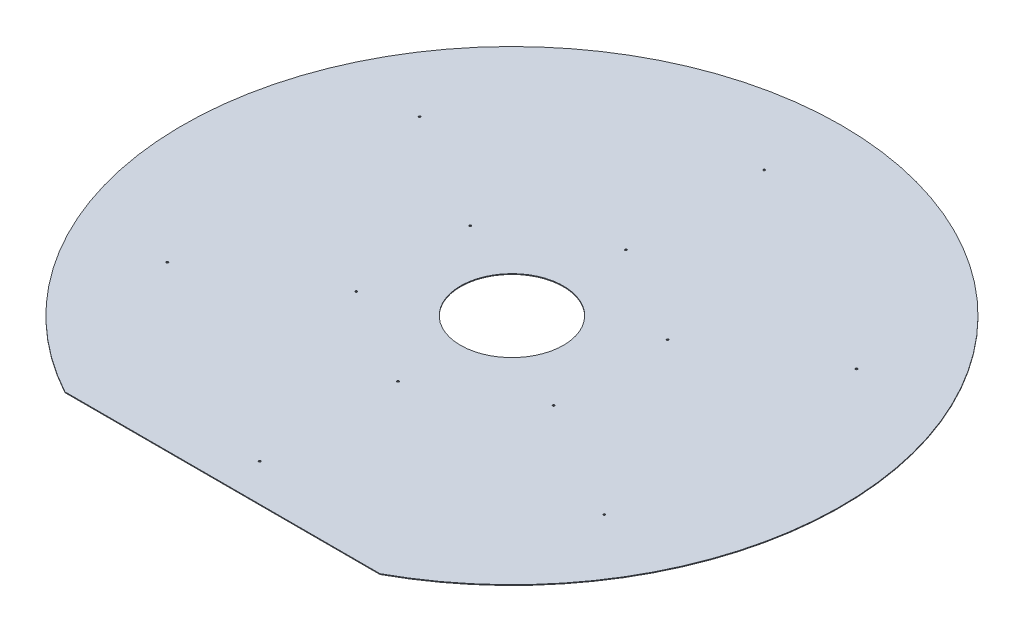
ISO-10303-21;
HEADER;
FILE_DESCRIPTION(('STEP AP214'),'2;1');
FILE_NAME('part.step','',(''),(''),'','','');
FILE_SCHEMA(('AUTOMOTIVE_DESIGN { 1 0 10303 214 1 1 1 1 }'));
ENDSEC;
DATA;
#1=APPLICATION_CONTEXT('core data for automotive mechanical design processes');
#2=APPLICATION_PROTOCOL_DEFINITION('international standard','automotive_design',2000,#1);
#3=PRODUCT_CONTEXT('',#1,'mechanical');
#4=PRODUCT('Part','Part','',(#3));
#5=PRODUCT_RELATED_PRODUCT_CATEGORY('part','',(#4));
#6=PRODUCT_DEFINITION_FORMATION('','',#4);
#7=PRODUCT_DEFINITION_CONTEXT('part definition',#1,'design');
#8=PRODUCT_DEFINITION('design','',#6,#7);
#9=PRODUCT_DEFINITION_SHAPE('','',#8);
#10=(LENGTH_UNIT() NAMED_UNIT(*) SI_UNIT(.MILLI.,.METRE.));
#11=(NAMED_UNIT(*) PLANE_ANGLE_UNIT() SI_UNIT($,.RADIAN.));
#12=(NAMED_UNIT(*) SI_UNIT($,.STERADIAN.) SOLID_ANGLE_UNIT());
#13=UNCERTAINTY_MEASURE_WITH_UNIT(LENGTH_MEASURE(1.E-05),#10,'distance_accuracy_value','');
#14=(GEOMETRIC_REPRESENTATION_CONTEXT(3) GLOBAL_UNCERTAINTY_ASSIGNED_CONTEXT((#13)) GLOBAL_UNIT_ASSIGNED_CONTEXT((#10,
#11,#12)) REPRESENTATION_CONTEXT('',''));
#15=CARTESIAN_POINT('',(0.,0.,0.));
#16=DIRECTION('',(0.,0.,1.));
#17=DIRECTION('',(1.,0.,0.));
#18=AXIS2_PLACEMENT_3D('',#15,#16,#17);
#19=CARTESIAN_POINT('',(0.,971.5,0.));
#20=DIRECTION('',(0.,1.,0.));
#21=DIRECTION('',(0.,0.,1.));
#22=AXIS2_PLACEMENT_3D('',#19,#20,#21);
#23=PLANE('',#22);
#24=CARTESIAN_POINT('',(0.,971.5,510.575));
#25=DIRECTION('',(0.,1.,0.));
#26=DIRECTION('',(0.,0.,1.));
#27=AXIS2_PLACEMENT_3D('',#24,#25,#26);
#28=CIRCLE('',#27,2.10000000000001);
#29=CARTESIAN_POINT('',(0.,971.5,512.675));
#30=VERTEX_POINT('',#29);
#31=EDGE_CURVE('E129',#30,#30,#28,.T.);
#32=ORIENTED_EDGE('',*,*,#31,.F.);
#33=EDGE_LOOP('',(#32));
#34=FACE_BOUND('',#33,.T.);
#35=CARTESIAN_POINT('',(199.683807477598,971.5,115.287499999998));
#36=DIRECTION('',(0.,1.,0.));
#37=DIRECTION('',(-0.866025403784443,0.,-0.499999999999992));
#38=AXIS2_PLACEMENT_3D('',#35,#36,#37);
#39=CIRCLE('',#38,2.1);
#40=CARTESIAN_POINT('',(197.865154129651,971.5,114.237499999998));
#41=VERTEX_POINT('',#40);
#42=EDGE_CURVE('E130',#41,#41,#39,.T.);
#43=ORIENTED_EDGE('',*,*,#42,.F.);
#44=EDGE_LOOP('',(#43));
#45=FACE_BOUND('',#44,.T.);
#46=CARTESIAN_POINT('',(442.170920537242,971.5,255.287499999996));
#47=DIRECTION('',(0.,1.,0.));
#48=DIRECTION('',(0.866025403784443,0.,0.499999999999992));
#49=AXIS2_PLACEMENT_3D('',#46,#47,#48);
#50=CIRCLE('',#49,2.10000000000001);
#51=CARTESIAN_POINT('',(443.989573885189,971.5,256.337499999996));
#52=VERTEX_POINT('',#51);
#53=EDGE_CURVE('E141',#52,#52,#50,.T.);
#54=ORIENTED_EDGE('',*,*,#53,.F.);
#55=EDGE_LOOP('',(#54));
#56=FACE_BOUND('',#55,.T.);
#57=CARTESIAN_POINT('',(199.683807477596,971.5,-115.287500000002));
#58=DIRECTION('',(0.,1.,0.));
#59=DIRECTION('',(-0.866025403784433,0.,0.50000000000001));
#60=AXIS2_PLACEMENT_3D('',#57,#58,#59);
#61=CIRCLE('',#60,2.1);
#62=CARTESIAN_POINT('',(197.865154129648,971.5,-114.237500000002));
#63=VERTEX_POINT('',#62);
#64=EDGE_CURVE('E142',#63,#63,#61,.T.);
#65=ORIENTED_EDGE('',*,*,#64,.F.);
#66=EDGE_LOOP('',(#65));
#67=FACE_BOUND('',#66,.T.);
#68=CARTESIAN_POINT('',(0.,971.5,230.575));
#69=DIRECTION('',(0.,1.,0.));
#70=DIRECTION('',(0.,0.,-1.));
#71=AXIS2_PLACEMENT_3D('',#68,#69,#70);
#72=CIRCLE('',#71,2.1);
#73=CARTESIAN_POINT('',(0.,971.5,228.475));
#74=VERTEX_POINT('',#73);
#75=EDGE_CURVE('E106',#74,#74,#72,.T.);
#76=ORIENTED_EDGE('',*,*,#75,.F.);
#77=EDGE_LOOP('',(#76));
#78=FACE_BOUND('',#77,.T.);
#79=CARTESIAN_POINT('',(-442.170920537239,971.5,255.287500000002));
#80=DIRECTION('',(0.,1.,0.));
#81=DIRECTION('',(-0.866025403784436,0.,0.500000000000004));
#82=AXIS2_PLACEMENT_3D('',#79,#80,#81);
#83=CIRCLE('',#82,2.10000000000001);
#84=CARTESIAN_POINT('',(-443.989573885186,971.5,256.337500000002));
#85=VERTEX_POINT('',#84);
#86=EDGE_CURVE('E105',#85,#85,#83,.T.);
#87=ORIENTED_EDGE('',*,*,#86,.F.);
#88=EDGE_LOOP('',(#87));
#89=FACE_BOUND('',#88,.T.);
#90=CARTESIAN_POINT('',(-199.683807477596,971.5,115.287500000001));
#91=DIRECTION('',(0.,1.,0.));
#92=DIRECTION('',(0.866025403784436,0.,-0.500000000000004));
#93=AXIS2_PLACEMENT_3D('',#90,#91,#92);
#94=CIRCLE('',#93,2.1);
#95=CARTESIAN_POINT('',(-197.865154129649,971.5,114.237500000001));
#96=VERTEX_POINT('',#95);
#97=EDGE_CURVE('E113',#96,#96,#94,.T.);
#98=ORIENTED_EDGE('',*,*,#97,.F.);
#99=EDGE_LOOP('',(#98));
#100=FACE_BOUND('',#99,.T.);
#101=CARTESIAN_POINT('',(-442.17092053724,971.5,-255.287499999999));
#102=DIRECTION('',(0.,1.,0.));
#103=DIRECTION('',(-0.86602540378444,0.,-0.499999999999998));
#104=AXIS2_PLACEMENT_3D('',#101,#102,#103);
#105=CIRCLE('',#104,2.10000000000001);
#106=CARTESIAN_POINT('',(-443.989573885188,971.5,-256.337499999999));
#107=VERTEX_POINT('',#106);
#108=EDGE_CURVE('E119',#107,#107,#105,.T.);
#109=ORIENTED_EDGE('',*,*,#108,.F.);
#110=EDGE_LOOP('',(#109));
#111=FACE_BOUND('',#110,.T.);
#112=CARTESIAN_POINT('',(442.170920537237,971.5,-255.287500000005));
#113=DIRECTION('',(0.,1.,0.));
#114=DIRECTION('',(0.866025403784433,0.,-0.50000000000001));
#115=AXIS2_PLACEMENT_3D('',#112,#113,#114);
#116=CIRCLE('',#115,2.10000000000001);
#117=CARTESIAN_POINT('',(443.989573885184,971.5,-256.337500000005));
#118=VERTEX_POINT('',#117);
#119=EDGE_CURVE('E152',#118,#118,#116,.T.);
#120=ORIENTED_EDGE('',*,*,#119,.F.);
#121=EDGE_LOOP('',(#120));
#122=FACE_BOUND('',#121,.T.);
#123=CARTESIAN_POINT('',(-199.683807477597,971.5,-115.2875));
#124=DIRECTION('',(0.,1.,0.));
#125=DIRECTION('',(0.86602540378444,0.,0.499999999999998));
#126=AXIS2_PLACEMENT_3D('',#123,#124,#125);
#127=CIRCLE('',#126,2.1);
#128=CARTESIAN_POINT('',(-197.86515412965,971.5,-114.2375));
#129=VERTEX_POINT('',#128);
#130=EDGE_CURVE('E98',#129,#129,#127,.T.);
#131=ORIENTED_EDGE('',*,*,#130,.F.);
#132=EDGE_LOOP('',(#131));
#133=FACE_BOUND('',#132,.T.);
#134=CARTESIAN_POINT('',(0.,971.5,-230.575));
#135=DIRECTION('',(0.,1.,0.));
#136=DIRECTION('',(0.,0.,1.));
#137=AXIS2_PLACEMENT_3D('',#134,#135,#136);
#138=CIRCLE('',#137,2.1);
#139=CARTESIAN_POINT('',(0.,971.5,-228.475));
#140=VERTEX_POINT('',#139);
#141=EDGE_CURVE('E87',#140,#140,#138,.T.);
#142=ORIENTED_EDGE('',*,*,#141,.F.);
#143=EDGE_LOOP('',(#142));
#144=FACE_BOUND('',#143,.T.);
#145=CARTESIAN_POINT('',(0.,971.5,-510.575));
#146=DIRECTION('',(0.,1.,0.));
#147=DIRECTION('',(0.,0.,-1.));
#148=AXIS2_PLACEMENT_3D('',#145,#146,#147);
#149=CIRCLE('',#148,2.10000000000001);
#150=CARTESIAN_POINT('',(0.,971.5,-512.675));
#151=VERTEX_POINT('',#150);
#152=EDGE_CURVE('E88',#151,#151,#149,.T.);
#153=ORIENTED_EDGE('',*,*,#152,.F.);
#154=EDGE_LOOP('',(#153));
#155=FACE_BOUND('',#154,.T.);
#156=CARTESIAN_POINT('',(0.,971.5,0.));
#157=DIRECTION('',(0.,1.,0.));
#158=DIRECTION('',(0.,0.,1.));
#159=AXIS2_PLACEMENT_3D('',#156,#157,#158);
#160=CIRCLE('',#159,667.);
#161=CARTESIAN_POINT('',(318.786091019822,971.5,585.88772659299));
#162=VERTEX_POINT('',#161);
#163=CARTESIAN_POINT('',(-318.786091019822,971.5,585.88772659299));
#164=VERTEX_POINT('',#163);
#165=EDGE_CURVE('E67',#162,#164,#160,.T.);
#166=ORIENTED_EDGE('',*,*,#165,.T.);
#167=DIRECTION('',(1.,0.,0.));
#168=VECTOR('',#167,1.);
#169=CARTESIAN_POINT('',(-318.786091019822,971.5,585.88772659299));
#170=LINE('',#169,#168);
#171=EDGE_CURVE('E52',#164,#162,#170,.T.);
#172=ORIENTED_EDGE('',*,*,#171,.T.);
#173=EDGE_LOOP('',(#166,#172));
#174=FACE_BOUND('',#173,.T.);
#175=CARTESIAN_POINT('',(0.,971.5,0.));
#176=DIRECTION('',(0.,1.,0.));
#177=DIRECTION('',(0.,0.,1.));
#178=AXIS2_PLACEMENT_3D('',#175,#176,#177);
#179=CIRCLE('',#178,104.15);
#180=CARTESIAN_POINT('',(0.,971.5,104.15));
#181=VERTEX_POINT('',#180);
#182=EDGE_CURVE('E73',#181,#181,#179,.T.);
#183=ORIENTED_EDGE('',*,*,#182,.F.);
#184=EDGE_LOOP('',(#183));
#185=FACE_BOUND('',#184,.T.);
#186=ADVANCED_FACE('F36',(#34,#45,#56,#67,#78,#89,#100,#111,#122,#133,#144,#155,#174,#185),#23,.T.);
#187=CARTESIAN_POINT('',(0.,970.,0.));
#188=DIRECTION('',(0.,1.,0.));
#189=DIRECTION('',(0.,0.,1.));
#190=AXIS2_PLACEMENT_3D('',#187,#188,#189);
#191=PLANE('',#190);
#192=CARTESIAN_POINT('',(0.,970.,510.575));
#193=DIRECTION('',(0.,1.,0.));
#194=DIRECTION('',(0.,0.,1.));
#195=AXIS2_PLACEMENT_3D('',#192,#193,#194);
#196=CIRCLE('',#195,2.10000000000001);
#197=CARTESIAN_POINT('',(0.,970.,512.675));
#198=VERTEX_POINT('',#197);
#199=EDGE_CURVE('E109',#198,#198,#196,.F.);
#200=ORIENTED_EDGE('',*,*,#199,.F.);
#201=EDGE_LOOP('',(#200));
#202=FACE_BOUND('',#201,.T.);
#203=CARTESIAN_POINT('',(199.683807477598,970.,115.287499999998));
#204=DIRECTION('',(0.,1.,0.));
#205=DIRECTION('',(0.,0.,1.));
#206=AXIS2_PLACEMENT_3D('',#203,#204,#205);
#207=CIRCLE('',#206,2.1);
#208=CARTESIAN_POINT('',(199.683807477598,970.,117.387499999998));
#209=VERTEX_POINT('',#208);
#210=EDGE_CURVE('E126',#209,#209,#207,.F.);
#211=ORIENTED_EDGE('',*,*,#210,.F.);
#212=EDGE_LOOP('',(#211));
#213=FACE_BOUND('',#212,.T.);
#214=CARTESIAN_POINT('',(442.170920537242,970.,255.287499999996));
#215=DIRECTION('',(0.,1.,0.));
#216=DIRECTION('',(0.,0.,1.));
#217=AXIS2_PLACEMENT_3D('',#214,#215,#216);
#218=CIRCLE('',#217,2.10000000000001);
#219=CARTESIAN_POINT('',(442.170920537242,970.,257.387499999996));
#220=VERTEX_POINT('',#219);
#221=EDGE_CURVE('E133',#220,#220,#218,.F.);
#222=ORIENTED_EDGE('',*,*,#221,.F.);
#223=EDGE_LOOP('',(#222));
#224=FACE_BOUND('',#223,.T.);
#225=CARTESIAN_POINT('',(199.683807477596,970.,-115.287500000002));
#226=DIRECTION('',(0.,1.,0.));
#227=DIRECTION('',(0.,0.,1.));
#228=AXIS2_PLACEMENT_3D('',#225,#226,#227);
#229=CIRCLE('',#228,2.1);
#230=CARTESIAN_POINT('',(199.683807477596,970.,-113.187500000002));
#231=VERTEX_POINT('',#230);
#232=EDGE_CURVE('E138',#231,#231,#229,.F.);
#233=ORIENTED_EDGE('',*,*,#232,.F.);
#234=EDGE_LOOP('',(#233));
#235=FACE_BOUND('',#234,.T.);
#236=CARTESIAN_POINT('',(0.,970.,230.575));
#237=DIRECTION('',(0.,1.,0.));
#238=DIRECTION('',(0.,0.,1.));
#239=AXIS2_PLACEMENT_3D('',#236,#237,#238);
#240=CIRCLE('',#239,2.1);
#241=CARTESIAN_POINT('',(0.,970.,232.675));
#242=VERTEX_POINT('',#241);
#243=EDGE_CURVE('E102',#242,#242,#240,.F.);
#244=ORIENTED_EDGE('',*,*,#243,.F.);
#245=EDGE_LOOP('',(#244));
#246=FACE_BOUND('',#245,.T.);
#247=CARTESIAN_POINT('',(-442.170920537239,970.,255.287500000002));
#248=DIRECTION('',(0.,1.,0.));
#249=DIRECTION('',(0.,0.,1.));
#250=AXIS2_PLACEMENT_3D('',#247,#248,#249);
#251=CIRCLE('',#250,2.10000000000001);
#252=CARTESIAN_POINT('',(-442.170920537239,970.,257.387500000002));
#253=VERTEX_POINT('',#252);
#254=EDGE_CURVE('E110',#253,#253,#251,.F.);
#255=ORIENTED_EDGE('',*,*,#254,.F.);
#256=EDGE_LOOP('',(#255));
#257=FACE_BOUND('',#256,.T.);
#258=CARTESIAN_POINT('',(-199.683807477596,970.,115.287500000001));
#259=DIRECTION('',(0.,1.,0.));
#260=DIRECTION('',(0.,0.,1.));
#261=AXIS2_PLACEMENT_3D('',#258,#259,#260);
#262=CIRCLE('',#261,2.1);
#263=CARTESIAN_POINT('',(-199.683807477596,970.,117.387500000001));
#264=VERTEX_POINT('',#263);
#265=EDGE_CURVE('E116',#264,#264,#262,.F.);
#266=ORIENTED_EDGE('',*,*,#265,.F.);
#267=EDGE_LOOP('',(#266));
#268=FACE_BOUND('',#267,.T.);
#269=CARTESIAN_POINT('',(-442.17092053724,970.,-255.287499999999));
#270=DIRECTION('',(0.,1.,0.));
#271=DIRECTION('',(0.,0.,1.));
#272=AXIS2_PLACEMENT_3D('',#269,#270,#271);
#273=CIRCLE('',#272,2.10000000000001);
#274=CARTESIAN_POINT('',(-442.17092053724,970.,-253.187499999999));
#275=VERTEX_POINT('',#274);
#276=EDGE_CURVE('E101',#275,#275,#273,.F.);
#277=ORIENTED_EDGE('',*,*,#276,.F.);
#278=EDGE_LOOP('',(#277));
#279=FACE_BOUND('',#278,.T.);
#280=CARTESIAN_POINT('',(442.170920537237,970.,-255.287500000005));
#281=DIRECTION('',(0.,1.,0.));
#282=DIRECTION('',(0.,0.,1.));
#283=AXIS2_PLACEMENT_3D('',#280,#281,#282);
#284=CIRCLE('',#283,2.10000000000001);
#285=CARTESIAN_POINT('',(442.170920537237,970.,-253.187500000005));
#286=VERTEX_POINT('',#285);
#287=EDGE_CURVE('E145',#286,#286,#284,.F.);
#288=ORIENTED_EDGE('',*,*,#287,.F.);
#289=EDGE_LOOP('',(#288));
#290=FACE_BOUND('',#289,.T.);
#291=CARTESIAN_POINT('',(-199.683807477597,970.,-115.2875));
#292=DIRECTION('',(0.,1.,0.));
#293=DIRECTION('',(0.,0.,1.));
#294=AXIS2_PLACEMENT_3D('',#291,#292,#293);
#295=CIRCLE('',#294,2.1);
#296=CARTESIAN_POINT('',(-199.683807477597,970.,-113.1875));
#297=VERTEX_POINT('',#296);
#298=EDGE_CURVE('E91',#297,#297,#295,.F.);
#299=ORIENTED_EDGE('',*,*,#298,.F.);
#300=EDGE_LOOP('',(#299));
#301=FACE_BOUND('',#300,.T.);
#302=CARTESIAN_POINT('',(0.,970.,-230.575));
#303=DIRECTION('',(0.,1.,0.));
#304=DIRECTION('',(0.,0.,1.));
#305=AXIS2_PLACEMENT_3D('',#302,#303,#304);
#306=CIRCLE('',#305,2.1);
#307=CARTESIAN_POINT('',(0.,970.,-228.475));
#308=VERTEX_POINT('',#307);
#309=EDGE_CURVE('E82',#308,#308,#306,.F.);
#310=ORIENTED_EDGE('',*,*,#309,.F.);
#311=EDGE_LOOP('',(#310));
#312=FACE_BOUND('',#311,.T.);
#313=CARTESIAN_POINT('',(0.,970.,-510.575));
#314=DIRECTION('',(0.,1.,0.));
#315=DIRECTION('',(0.,0.,1.));
#316=AXIS2_PLACEMENT_3D('',#313,#314,#315);
#317=CIRCLE('',#316,2.10000000000001);
#318=CARTESIAN_POINT('',(0.,970.,-508.475));
#319=VERTEX_POINT('',#318);
#320=EDGE_CURVE('E84',#319,#319,#317,.F.);
#321=ORIENTED_EDGE('',*,*,#320,.F.);
#322=EDGE_LOOP('',(#321));
#323=FACE_BOUND('',#322,.T.);
#324=CARTESIAN_POINT('',(0.,970.,0.));
#325=DIRECTION('',(0.,1.,0.));
#326=DIRECTION('',(0.,0.,1.));
#327=AXIS2_PLACEMENT_3D('',#324,#325,#326);
#328=CIRCLE('',#327,667.);
#329=CARTESIAN_POINT('',(318.786091019822,970.,585.88772659299));
#330=VERTEX_POINT('',#329);
#331=CARTESIAN_POINT('',(-318.786091019822,970.,585.88772659299));
#332=VERTEX_POINT('',#331);
#333=EDGE_CURVE('E68',#330,#332,#328,.T.);
#334=ORIENTED_EDGE('',*,*,#333,.F.);
#335=DIRECTION('',(1.,0.,0.));
#336=VECTOR('',#335,1.);
#337=CARTESIAN_POINT('',(-318.786091019822,970.,585.88772659299));
#338=LINE('',#337,#336);
#339=EDGE_CURVE('E60',#332,#330,#338,.T.);
#340=ORIENTED_EDGE('',*,*,#339,.F.);
#341=EDGE_LOOP('',(#334,#340));
#342=FACE_BOUND('',#341,.T.);
#343=CARTESIAN_POINT('',(0.,970.,0.));
#344=DIRECTION('',(0.,1.,0.));
#345=DIRECTION('',(0.,0.,1.));
#346=AXIS2_PLACEMENT_3D('',#343,#344,#345);
#347=CIRCLE('',#346,104.15);
#348=CARTESIAN_POINT('',(0.,970.,104.15));
#349=VERTEX_POINT('',#348);
#350=EDGE_CURVE('E76',#349,#349,#347,.T.);
#351=ORIENTED_EDGE('',*,*,#350,.T.);
#352=EDGE_LOOP('',(#351));
#353=FACE_BOUND('',#352,.T.);
#354=ADVANCED_FACE('F71',(#202,#213,#224,#235,#246,#257,#268,#279,#290,#301,#312,#323,#342,
#353),#191,.F.);
#355=CARTESIAN_POINT('',(0.,971.5,0.));
#356=DIRECTION('',(0.,-1.,0.));
#357=DIRECTION('',(0.,0.,-1.));
#358=AXIS2_PLACEMENT_3D('',#355,#356,#357);
#359=CYLINDRICAL_SURFACE('',#358,667.);
#360=ORIENTED_EDGE('',*,*,#333,.T.);
#361=DIRECTION('',(0.,-1.,0.));
#362=VECTOR('',#361,1.);
#363=CARTESIAN_POINT('',(-318.786091019822,971.5,585.88772659299));
#364=LINE('',#363,#362);
#365=EDGE_CURVE('E11',#164,#332,#364,.T.);
#366=ORIENTED_EDGE('',*,*,#365,.F.);
#367=ORIENTED_EDGE('',*,*,#165,.F.);
#368=DIRECTION('',(0.,-1.,0.));
#369=VECTOR('',#368,1.);
#370=CARTESIAN_POINT('',(318.786091019822,971.5,585.88772659299));
#371=LINE('',#370,#369);
#372=EDGE_CURVE('E45',#162,#330,#371,.T.);
#373=ORIENTED_EDGE('',*,*,#372,.T.);
#374=EDGE_LOOP('',(#360,#366,#367,#373));
#375=FACE_BOUND('',#374,.T.);
#376=ADVANCED_FACE('F38',(#375),#359,.T.);
#377=CARTESIAN_POINT('',(-318.786091019822,971.5,585.88772659299));
#378=DIRECTION('',(0.,0.,-1.));
#379=DIRECTION('',(-1.,0.,0.));
#380=AXIS2_PLACEMENT_3D('',#377,#378,#379);
#381=PLANE('',#380);
#382=ORIENTED_EDGE('',*,*,#339,.T.);
#383=ORIENTED_EDGE('',*,*,#372,.F.);
#384=ORIENTED_EDGE('',*,*,#171,.F.);
#385=ORIENTED_EDGE('',*,*,#365,.T.);
#386=EDGE_LOOP('',(#382,#383,#384,#385));
#387=FACE_BOUND('',#386,.T.);
#388=ADVANCED_FACE('F63',(#387),#381,.F.);
#389=CARTESIAN_POINT('',(0.,971.5,0.));
#390=DIRECTION('',(0.,-1.,0.));
#391=DIRECTION('',(0.,0.,-1.));
#392=AXIS2_PLACEMENT_3D('',#389,#390,#391);
#393=CYLINDRICAL_SURFACE('',#392,104.15);
#394=ORIENTED_EDGE('',*,*,#182,.T.);
#395=EDGE_LOOP('',(#394));
#396=FACE_BOUND('',#395,.T.);
#397=ORIENTED_EDGE('',*,*,#350,.F.);
#398=EDGE_LOOP('',(#397));
#399=FACE_BOUND('',#398,.T.);
#400=ADVANCED_FACE('F171',(#396,#399),#393,.F.);
#401=CARTESIAN_POINT('',(0.,-36.0010000000001,-510.575));
#402=DIRECTION('',(0.,1.,0.));
#403=DIRECTION('',(0.,0.,1.));
#404=AXIS2_PLACEMENT_3D('',#401,#402,#403);
#405=CYLINDRICAL_SURFACE('',#404,2.10000000000001);
#406=ORIENTED_EDGE('',*,*,#152,.T.);
#407=EDGE_LOOP('',(#406));
#408=FACE_BOUND('',#407,.T.);
#409=ORIENTED_EDGE('',*,*,#320,.T.);
#410=EDGE_LOOP('',(#409));
#411=FACE_BOUND('',#410,.T.);
#412=ADVANCED_FACE('F174',(#408,#411),#405,.F.);
#413=CARTESIAN_POINT('',(0.,-36.0010000000001,-230.575));
#414=DIRECTION('',(0.,1.,0.));
#415=DIRECTION('',(0.,0.,1.));
#416=AXIS2_PLACEMENT_3D('',#413,#414,#415);
#417=CYLINDRICAL_SURFACE('',#416,2.1);
#418=ORIENTED_EDGE('',*,*,#141,.T.);
#419=EDGE_LOOP('',(#418));
#420=FACE_BOUND('',#419,.T.);
#421=ORIENTED_EDGE('',*,*,#309,.T.);
#422=EDGE_LOOP('',(#421));
#423=FACE_BOUND('',#422,.T.);
#424=ADVANCED_FACE('F202',(#420,#423),#417,.F.);
#425=CARTESIAN_POINT('',(-199.683807477597,969.999,-115.2875));
#426=DIRECTION('',(0.,1.,0.));
#427=DIRECTION('',(0.,0.,1.));
#428=AXIS2_PLACEMENT_3D('',#425,#426,#427);
#429=CYLINDRICAL_SURFACE('',#428,2.1);
#430=ORIENTED_EDGE('',*,*,#130,.T.);
#431=EDGE_LOOP('',(#430));
#432=FACE_BOUND('',#431,.T.);
#433=ORIENTED_EDGE('',*,*,#298,.T.);
#434=EDGE_LOOP('',(#433));
#435=FACE_BOUND('',#434,.T.);
#436=ADVANCED_FACE('F211',(#432,#435),#429,.F.);
#437=CARTESIAN_POINT('',(442.170920537237,969.999,-255.287500000005));
#438=DIRECTION('',(0.,1.,0.));
#439=DIRECTION('',(0.,0.,1.));
#440=AXIS2_PLACEMENT_3D('',#437,#438,#439);
#441=CYLINDRICAL_SURFACE('',#440,2.10000000000001);
#442=ORIENTED_EDGE('',*,*,#119,.T.);
#443=EDGE_LOOP('',(#442));
#444=FACE_BOUND('',#443,.T.);
#445=ORIENTED_EDGE('',*,*,#287,.T.);
#446=EDGE_LOOP('',(#445));
#447=FACE_BOUND('',#446,.T.);
#448=ADVANCED_FACE('F156',(#444,#447),#441,.F.);
#449=CARTESIAN_POINT('',(-442.17092053724,969.999,-255.287499999999));
#450=DIRECTION('',(0.,1.,0.));
#451=DIRECTION('',(0.,0.,1.));
#452=AXIS2_PLACEMENT_3D('',#449,#450,#451);
#453=CYLINDRICAL_SURFACE('',#452,2.10000000000001);
#454=ORIENTED_EDGE('',*,*,#108,.T.);
#455=EDGE_LOOP('',(#454));
#456=FACE_BOUND('',#455,.T.);
#457=ORIENTED_EDGE('',*,*,#276,.T.);
#458=EDGE_LOOP('',(#457));
#459=FACE_BOUND('',#458,.T.);
#460=ADVANCED_FACE('F228',(#456,#459),#453,.F.);
#461=CARTESIAN_POINT('',(-199.683807477596,969.999,115.287500000001));
#462=DIRECTION('',(0.,1.,0.));
#463=DIRECTION('',(0.,0.,1.));
#464=AXIS2_PLACEMENT_3D('',#461,#462,#463);
#465=CYLINDRICAL_SURFACE('',#464,2.1);
#466=ORIENTED_EDGE('',*,*,#97,.T.);
#467=EDGE_LOOP('',(#466));
#468=FACE_BOUND('',#467,.T.);
#469=ORIENTED_EDGE('',*,*,#265,.T.);
#470=EDGE_LOOP('',(#469));
#471=FACE_BOUND('',#470,.T.);
#472=ADVANCED_FACE('F236',(#468,#471),#465,.F.);
#473=CARTESIAN_POINT('',(-442.170920537239,969.999,255.287500000002));
#474=DIRECTION('',(0.,1.,0.));
#475=DIRECTION('',(0.,0.,1.));
#476=AXIS2_PLACEMENT_3D('',#473,#474,#475);
#477=CYLINDRICAL_SURFACE('',#476,2.10000000000001);
#478=ORIENTED_EDGE('',*,*,#86,.T.);
#479=EDGE_LOOP('',(#478));
#480=FACE_BOUND('',#479,.T.);
#481=ORIENTED_EDGE('',*,*,#254,.T.);
#482=EDGE_LOOP('',(#481));
#483=FACE_BOUND('',#482,.T.);
#484=ADVANCED_FACE('F245',(#480,#483),#477,.F.);
#485=CARTESIAN_POINT('',(0.,969.999,230.575));
#486=DIRECTION('',(0.,1.,0.));
#487=DIRECTION('',(0.,0.,1.));
#488=AXIS2_PLACEMENT_3D('',#485,#486,#487);
#489=CYLINDRICAL_SURFACE('',#488,2.1);
#490=ORIENTED_EDGE('',*,*,#75,.T.);
#491=EDGE_LOOP('',(#490));
#492=FACE_BOUND('',#491,.T.);
#493=ORIENTED_EDGE('',*,*,#243,.T.);
#494=EDGE_LOOP('',(#493));
#495=FACE_BOUND('',#494,.T.);
#496=ADVANCED_FACE('F254',(#492,#495),#489,.F.);
#497=CARTESIAN_POINT('',(199.683807477596,969.999,-115.287500000002));
#498=DIRECTION('',(0.,1.,0.));
#499=DIRECTION('',(0.,0.,1.));
#500=AXIS2_PLACEMENT_3D('',#497,#498,#499);
#501=CYLINDRICAL_SURFACE('',#500,2.1);
#502=ORIENTED_EDGE('',*,*,#64,.T.);
#503=EDGE_LOOP('',(#502));
#504=FACE_BOUND('',#503,.T.);
#505=ORIENTED_EDGE('',*,*,#232,.T.);
#506=EDGE_LOOP('',(#505));
#507=FACE_BOUND('',#506,.T.);
#508=ADVANCED_FACE('F263',(#504,#507),#501,.F.);
#509=CARTESIAN_POINT('',(442.170920537242,969.999,255.287499999996));
#510=DIRECTION('',(0.,1.,0.));
#511=DIRECTION('',(0.,0.,1.));
#512=AXIS2_PLACEMENT_3D('',#509,#510,#511);
#513=CYLINDRICAL_SURFACE('',#512,2.10000000000001);
#514=ORIENTED_EDGE('',*,*,#53,.T.);
#515=EDGE_LOOP('',(#514));
#516=FACE_BOUND('',#515,.T.);
#517=ORIENTED_EDGE('',*,*,#221,.T.);
#518=EDGE_LOOP('',(#517));
#519=FACE_BOUND('',#518,.T.);
#520=ADVANCED_FACE('F272',(#516,#519),#513,.F.);
#521=CARTESIAN_POINT('',(199.683807477598,969.999,115.287499999998));
#522=DIRECTION('',(0.,1.,0.));
#523=DIRECTION('',(0.,0.,1.));
#524=AXIS2_PLACEMENT_3D('',#521,#522,#523);
#525=CYLINDRICAL_SURFACE('',#524,2.1);
#526=ORIENTED_EDGE('',*,*,#42,.T.);
#527=EDGE_LOOP('',(#526));
#528=FACE_BOUND('',#527,.T.);
#529=ORIENTED_EDGE('',*,*,#210,.T.);
#530=EDGE_LOOP('',(#529));
#531=FACE_BOUND('',#530,.T.);
#532=ADVANCED_FACE('F281',(#528,#531),#525,.F.);
#533=CARTESIAN_POINT('',(0.,969.999,510.575));
#534=DIRECTION('',(0.,1.,0.));
#535=DIRECTION('',(0.,0.,1.));
#536=AXIS2_PLACEMENT_3D('',#533,#534,#535);
#537=CYLINDRICAL_SURFACE('',#536,2.10000000000001);
#538=ORIENTED_EDGE('',*,*,#31,.T.);
#539=EDGE_LOOP('',(#538));
#540=FACE_BOUND('',#539,.T.);
#541=ORIENTED_EDGE('',*,*,#199,.T.);
#542=EDGE_LOOP('',(#541));
#543=FACE_BOUND('',#542,.T.);
#544=ADVANCED_FACE('F290',(#540,#543),#537,.F.);
#545=CLOSED_SHELL('',(#186,#354,#376,#388,#400,#412,#424,#436,#448,#460,#472,#484,#496,#508,
#520,#532,#544));
#546=MANIFOLD_SOLID_BREP('B2',#545);
#547=ADVANCED_BREP_SHAPE_REPRESENTATION('',(#18,#546),#14);
#548=SHAPE_DEFINITION_REPRESENTATION(#9,#547);
ENDSEC;
END-ISO-10303-21;
